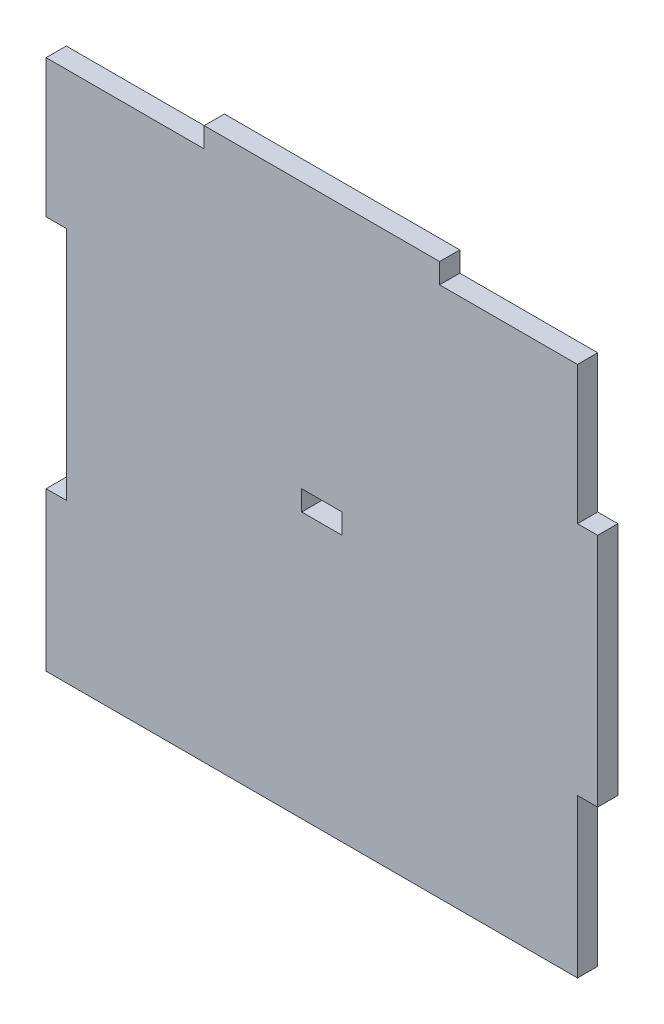
ISO-10303-21;
HEADER;
FILE_DESCRIPTION(('STEP AP214'),'2;1');
FILE_NAME('part.step','',(''),(''),'','','');
FILE_SCHEMA(('AUTOMOTIVE_DESIGN { 1 0 10303 214 1 1 1 1 }'));
ENDSEC;
DATA;
#1=APPLICATION_CONTEXT('core data for automotive mechanical design processes');
#2=APPLICATION_PROTOCOL_DEFINITION('international standard','automotive_design',2000,#1);
#3=PRODUCT_CONTEXT('',#1,'mechanical');
#4=PRODUCT('Part','Part','',(#3));
#5=PRODUCT_RELATED_PRODUCT_CATEGORY('part','',(#4));
#6=PRODUCT_DEFINITION_FORMATION('','',#4);
#7=PRODUCT_DEFINITION_CONTEXT('part definition',#1,'design');
#8=PRODUCT_DEFINITION('design','',#6,#7);
#9=PRODUCT_DEFINITION_SHAPE('','',#8);
#10=(LENGTH_UNIT() NAMED_UNIT(*) SI_UNIT(.MILLI.,.METRE.));
#11=(NAMED_UNIT(*) PLANE_ANGLE_UNIT() SI_UNIT($,.RADIAN.));
#12=(NAMED_UNIT(*) SI_UNIT($,.STERADIAN.) SOLID_ANGLE_UNIT());
#13=UNCERTAINTY_MEASURE_WITH_UNIT(LENGTH_MEASURE(1.E-05),#10,'distance_accuracy_value','');
#14=(GEOMETRIC_REPRESENTATION_CONTEXT(3) GLOBAL_UNCERTAINTY_ASSIGNED_CONTEXT((#13)) GLOBAL_UNIT_ASSIGNED_CONTEXT((#10,
#11,#12)) REPRESENTATION_CONTEXT('',''));
#15=CARTESIAN_POINT('',(0.,0.,0.));
#16=DIRECTION('',(0.,0.,1.));
#17=DIRECTION('',(1.,0.,0.));
#18=AXIS2_PLACEMENT_3D('',#15,#16,#17);
#19=CARTESIAN_POINT('',(38.,-16.,3.));
#20=DIRECTION('',(0.,1.,0.));
#21=DIRECTION('',(-1.,0.,0.));
#22=AXIS2_PLACEMENT_3D('',#19,#20,#21);
#23=PLANE('',#22);
#24=DIRECTION('',(1.,0.,0.));
#25=VECTOR('',#24,1.);
#26=CARTESIAN_POINT('',(38.,-16.,0.));
#27=LINE('',#26,#25);
#28=CARTESIAN_POINT('',(38.,-16.,0.));
#29=VERTEX_POINT('',#28);
#30=CARTESIAN_POINT('',(41.,-16.,0.));
#31=VERTEX_POINT('',#30);
#32=EDGE_CURVE('E218',#29,#31,#27,.T.);
#33=ORIENTED_EDGE('',*,*,#32,.T.);
#34=DIRECTION('',(0.,0.,-1.));
#35=VECTOR('',#34,1.);
#36=CARTESIAN_POINT('',(41.,-16.,3.));
#37=LINE('',#36,#35);
#38=CARTESIAN_POINT('',(41.,-16.,3.));
#39=VERTEX_POINT('',#38);
#40=EDGE_CURVE('E11',#39,#31,#37,.T.);
#41=ORIENTED_EDGE('',*,*,#40,.F.);
#42=DIRECTION('',(1.,0.,0.));
#43=VECTOR('',#42,1.);
#44=CARTESIAN_POINT('',(38.,-16.,3.));
#45=LINE('',#44,#43);
#46=CARTESIAN_POINT('',(38.,-16.,3.));
#47=VERTEX_POINT('',#46);
#48=EDGE_CURVE('E224',#47,#39,#45,.T.);
#49=ORIENTED_EDGE('',*,*,#48,.F.);
#50=DIRECTION('',(0.,0.,-1.));
#51=VECTOR('',#50,1.);
#52=CARTESIAN_POINT('',(38.,-16.,3.));
#53=LINE('',#52,#51);
#54=EDGE_CURVE('E274',#47,#29,#53,.T.);
#55=ORIENTED_EDGE('',*,*,#54,.T.);
#56=EDGE_LOOP('',(#33,#41,#49,#55));
#57=FACE_BOUND('',#56,.T.);
#58=ADVANCED_FACE('F38',(#57),#23,.F.);
#59=CARTESIAN_POINT('',(41.,16.,3.));
#60=DIRECTION('',(-1.,0.,0.));
#61=DIRECTION('',(0.,0.,1.));
#62=AXIS2_PLACEMENT_3D('',#59,#60,#61);
#63=PLANE('',#62);
#64=DIRECTION('',(0.,1.,0.));
#65=VECTOR('',#64,1.);
#66=CARTESIAN_POINT('',(41.,16.,0.));
#67=LINE('',#66,#65);
#68=CARTESIAN_POINT('',(41.,19.,0.));
#69=VERTEX_POINT('',#68);
#70=EDGE_CURVE('E278',#31,#69,#67,.T.);
#71=ORIENTED_EDGE('',*,*,#70,.T.);
#72=DIRECTION('',(0.,0.,-1.));
#73=VECTOR('',#72,1.);
#74=CARTESIAN_POINT('',(41.,19.,3.));
#75=LINE('',#74,#73);
#76=CARTESIAN_POINT('',(41.,19.,3.));
#77=VERTEX_POINT('',#76);
#78=EDGE_CURVE('E46',#77,#69,#75,.T.);
#79=ORIENTED_EDGE('',*,*,#78,.F.);
#80=DIRECTION('',(0.,1.,0.));
#81=VECTOR('',#80,1.);
#82=CARTESIAN_POINT('',(41.,16.,3.));
#83=LINE('',#82,#81);
#84=EDGE_CURVE('E228',#39,#77,#83,.T.);
#85=ORIENTED_EDGE('',*,*,#84,.F.);
#86=ORIENTED_EDGE('',*,*,#40,.T.);
#87=EDGE_LOOP('',(#71,#79,#85,#86));
#88=FACE_BOUND('',#87,.T.);
#89=ADVANCED_FACE('F407',(#88),#63,.F.);
#90=CARTESIAN_POINT('',(41.,19.,3.));
#91=DIRECTION('',(0.,-1.,0.));
#92=DIRECTION('',(0.,0.,-1.));
#93=AXIS2_PLACEMENT_3D('',#90,#91,#92);
#94=PLANE('',#93);
#95=DIRECTION('',(-1.,0.,0.));
#96=VECTOR('',#95,1.);
#97=CARTESIAN_POINT('',(41.,19.,0.));
#98=LINE('',#97,#96);
#99=CARTESIAN_POINT('',(38.,19.,0.));
#100=VERTEX_POINT('',#99);
#101=EDGE_CURVE('E281',#69,#100,#98,.T.);
#102=ORIENTED_EDGE('',*,*,#101,.T.);
#103=DIRECTION('',(0.,0.,-1.));
#104=VECTOR('',#103,1.);
#105=CARTESIAN_POINT('',(38.,19.,3.));
#106=LINE('',#105,#104);
#107=CARTESIAN_POINT('',(38.,19.,3.));
#108=VERTEX_POINT('',#107);
#109=EDGE_CURVE('E377',#108,#100,#106,.T.);
#110=ORIENTED_EDGE('',*,*,#109,.F.);
#111=DIRECTION('',(-1.,0.,0.));
#112=VECTOR('',#111,1.);
#113=CARTESIAN_POINT('',(41.,19.,3.));
#114=LINE('',#113,#112);
#115=EDGE_CURVE('E232',#77,#108,#114,.T.);
#116=ORIENTED_EDGE('',*,*,#115,.F.);
#117=ORIENTED_EDGE('',*,*,#78,.T.);
#118=EDGE_LOOP('',(#102,#110,#116,#117));
#119=FACE_BOUND('',#118,.T.);
#120=ADVANCED_FACE('F386',(#119),#94,.F.);
#121=CARTESIAN_POINT('',(38.,39.5,3.));
#122=DIRECTION('',(-1.,0.,0.));
#123=DIRECTION('',(0.,-1.,0.));
#124=AXIS2_PLACEMENT_3D('',#121,#122,#123);
#125=PLANE('',#124);
#126=DIRECTION('',(0.,1.,0.));
#127=VECTOR('',#126,1.);
#128=CARTESIAN_POINT('',(38.,39.5,0.));
#129=LINE('',#128,#127);
#130=CARTESIAN_POINT('',(38.,39.5,0.));
#131=VERTEX_POINT('',#130);
#132=EDGE_CURVE('E284',#100,#131,#129,.T.);
#133=ORIENTED_EDGE('',*,*,#132,.T.);
#134=DIRECTION('',(0.,0.,-1.));
#135=VECTOR('',#134,1.);
#136=CARTESIAN_POINT('',(38.,39.5,3.));
#137=LINE('',#136,#135);
#138=CARTESIAN_POINT('',(38.,39.5,3.));
#139=VERTEX_POINT('',#138);
#140=EDGE_CURVE('E373',#139,#131,#137,.T.);
#141=ORIENTED_EDGE('',*,*,#140,.F.);
#142=DIRECTION('',(0.,1.,0.));
#143=VECTOR('',#142,1.);
#144=CARTESIAN_POINT('',(38.,39.5,3.));
#145=LINE('',#144,#143);
#146=EDGE_CURVE('E235',#108,#139,#145,.T.);
#147=ORIENTED_EDGE('',*,*,#146,.F.);
#148=ORIENTED_EDGE('',*,*,#109,.T.);
#149=EDGE_LOOP('',(#133,#141,#147,#148));
#150=FACE_BOUND('',#149,.T.);
#151=ADVANCED_FACE('F395',(#150),#125,.F.);
#152=CARTESIAN_POINT('',(17.5,39.5,3.));
#153=DIRECTION('',(0.,-1.,0.));
#154=DIRECTION('',(1.,0.,0.));
#155=AXIS2_PLACEMENT_3D('',#152,#153,#154);
#156=PLANE('',#155);
#157=DIRECTION('',(-1.,0.,0.));
#158=VECTOR('',#157,1.);
#159=CARTESIAN_POINT('',(17.5,39.5,0.));
#160=LINE('',#159,#158);
#161=CARTESIAN_POINT('',(17.5,39.5,0.));
#162=VERTEX_POINT('',#161);
#163=EDGE_CURVE('E287',#131,#162,#160,.T.);
#164=ORIENTED_EDGE('',*,*,#163,.T.);
#165=DIRECTION('',(0.,0.,-1.));
#166=VECTOR('',#165,1.);
#167=CARTESIAN_POINT('',(17.5,39.5,3.));
#168=LINE('',#167,#166);
#169=CARTESIAN_POINT('',(17.5,39.5,3.));
#170=VERTEX_POINT('',#169);
#171=EDGE_CURVE('E369',#170,#162,#168,.T.);
#172=ORIENTED_EDGE('',*,*,#171,.F.);
#173=DIRECTION('',(-1.,0.,0.));
#174=VECTOR('',#173,1.);
#175=CARTESIAN_POINT('',(17.5,39.5,3.));
#176=LINE('',#175,#174);
#177=EDGE_CURVE('E238',#139,#170,#176,.T.);
#178=ORIENTED_EDGE('',*,*,#177,.F.);
#179=ORIENTED_EDGE('',*,*,#140,.T.);
#180=EDGE_LOOP('',(#164,#172,#178,#179));
#181=FACE_BOUND('',#180,.T.);
#182=ADVANCED_FACE('F399',(#181),#156,.F.);
#183=CARTESIAN_POINT('',(17.5,42.5,3.));
#184=DIRECTION('',(-1.,0.,0.));
#185=DIRECTION('',(0.,-1.,0.));
#186=AXIS2_PLACEMENT_3D('',#183,#184,#185);
#187=PLANE('',#186);
#188=DIRECTION('',(0.,1.,0.));
#189=VECTOR('',#188,1.);
#190=CARTESIAN_POINT('',(17.5,42.5,0.));
#191=LINE('',#190,#189);
#192=CARTESIAN_POINT('',(17.5,42.5,0.));
#193=VERTEX_POINT('',#192);
#194=EDGE_CURVE('E290',#162,#193,#191,.T.);
#195=ORIENTED_EDGE('',*,*,#194,.T.);
#196=DIRECTION('',(0.,0.,-1.));
#197=VECTOR('',#196,1.);
#198=CARTESIAN_POINT('',(17.5,42.5,3.));
#199=LINE('',#198,#197);
#200=CARTESIAN_POINT('',(17.5,42.5,3.));
#201=VERTEX_POINT('',#200);
#202=EDGE_CURVE('E365',#201,#193,#199,.T.);
#203=ORIENTED_EDGE('',*,*,#202,.F.);
#204=DIRECTION('',(0.,1.,0.));
#205=VECTOR('',#204,1.);
#206=CARTESIAN_POINT('',(17.5,42.5,3.));
#207=LINE('',#206,#205);
#208=EDGE_CURVE('E241',#170,#201,#207,.T.);
#209=ORIENTED_EDGE('',*,*,#208,.F.);
#210=ORIENTED_EDGE('',*,*,#171,.T.);
#211=EDGE_LOOP('',(#195,#203,#209,#210));
#212=FACE_BOUND('',#211,.T.);
#213=ADVANCED_FACE('F456',(#212),#187,.F.);
#214=CARTESIAN_POINT('',(-17.5,42.5,3.));
#215=DIRECTION('',(0.,-1.,0.));
#216=DIRECTION('',(0.,0.,-1.));
#217=AXIS2_PLACEMENT_3D('',#214,#215,#216);
#218=PLANE('',#217);
#219=DIRECTION('',(-1.,0.,0.));
#220=VECTOR('',#219,1.);
#221=CARTESIAN_POINT('',(-17.5,42.5,0.));
#222=LINE('',#221,#220);
#223=CARTESIAN_POINT('',(-17.5,42.5,0.));
#224=VERTEX_POINT('',#223);
#225=EDGE_CURVE('E293',#193,#224,#222,.T.);
#226=ORIENTED_EDGE('',*,*,#225,.T.);
#227=DIRECTION('',(0.,0.,-1.));
#228=VECTOR('',#227,1.);
#229=CARTESIAN_POINT('',(-17.5,42.5,3.));
#230=LINE('',#229,#228);
#231=CARTESIAN_POINT('',(-17.5,42.5,3.));
#232=VERTEX_POINT('',#231);
#233=EDGE_CURVE('E361',#232,#224,#230,.T.);
#234=ORIENTED_EDGE('',*,*,#233,.F.);
#235=DIRECTION('',(-1.,0.,0.));
#236=VECTOR('',#235,1.);
#237=CARTESIAN_POINT('',(-17.5,42.5,3.));
#238=LINE('',#237,#236);
#239=EDGE_CURVE('E244',#201,#232,#238,.T.);
#240=ORIENTED_EDGE('',*,*,#239,.F.);
#241=ORIENTED_EDGE('',*,*,#202,.T.);
#242=EDGE_LOOP('',(#226,#234,#240,#241));
#243=FACE_BOUND('',#242,.T.);
#244=ADVANCED_FACE('F454',(#243),#218,.F.);
#245=CARTESIAN_POINT('',(-17.5,39.5,3.));
#246=DIRECTION('',(1.,0.,0.));
#247=DIRECTION('',(0.,0.,-1.));
#248=AXIS2_PLACEMENT_3D('',#245,#246,#247);
#249=PLANE('',#248);
#250=DIRECTION('',(0.,-1.,0.));
#251=VECTOR('',#250,1.);
#252=CARTESIAN_POINT('',(-17.5,39.5,0.));
#253=LINE('',#252,#251);
#254=CARTESIAN_POINT('',(-17.5,39.5,0.));
#255=VERTEX_POINT('',#254);
#256=EDGE_CURVE('E296',#224,#255,#253,.T.);
#257=ORIENTED_EDGE('',*,*,#256,.T.);
#258=DIRECTION('',(0.,0.,-1.));
#259=VECTOR('',#258,1.);
#260=CARTESIAN_POINT('',(-17.5,39.5,3.));
#261=LINE('',#260,#259);
#262=CARTESIAN_POINT('',(-17.5,39.5,3.));
#263=VERTEX_POINT('',#262);
#264=EDGE_CURVE('E357',#263,#255,#261,.T.);
#265=ORIENTED_EDGE('',*,*,#264,.F.);
#266=DIRECTION('',(0.,-1.,0.));
#267=VECTOR('',#266,1.);
#268=CARTESIAN_POINT('',(-17.5,39.5,3.));
#269=LINE('',#268,#267);
#270=EDGE_CURVE('E247',#232,#263,#269,.T.);
#271=ORIENTED_EDGE('',*,*,#270,.F.);
#272=ORIENTED_EDGE('',*,*,#233,.T.);
#273=EDGE_LOOP('',(#257,#265,#271,#272));
#274=FACE_BOUND('',#273,.T.);
#275=ADVANCED_FACE('F447',(#274),#249,.F.);
#276=CARTESIAN_POINT('',(-41.,39.5,3.));
#277=DIRECTION('',(0.,-1.,0.));
#278=DIRECTION('',(0.,0.,-1.));
#279=AXIS2_PLACEMENT_3D('',#276,#277,#278);
#280=PLANE('',#279);
#281=DIRECTION('',(-1.,0.,0.));
#282=VECTOR('',#281,1.);
#283=CARTESIAN_POINT('',(-41.,39.5,0.));
#284=LINE('',#283,#282);
#285=CARTESIAN_POINT('',(-41.,39.5,0.));
#286=VERTEX_POINT('',#285);
#287=EDGE_CURVE('E300',#255,#286,#284,.T.);
#288=ORIENTED_EDGE('',*,*,#287,.T.);
#289=DIRECTION('',(0.,0.,-1.));
#290=VECTOR('',#289,1.);
#291=CARTESIAN_POINT('',(-41.,39.5,3.));
#292=LINE('',#291,#290);
#293=CARTESIAN_POINT('',(-41.,39.5,3.));
#294=VERTEX_POINT('',#293);
#295=EDGE_CURVE('E353',#294,#286,#292,.T.);
#296=ORIENTED_EDGE('',*,*,#295,.F.);
#297=DIRECTION('',(-1.,0.,0.));
#298=VECTOR('',#297,1.);
#299=CARTESIAN_POINT('',(-38.,39.5,3.));
#300=LINE('',#299,#298);
#301=EDGE_CURVE('E250',#263,#294,#300,.T.);
#302=ORIENTED_EDGE('',*,*,#301,.F.);
#303=ORIENTED_EDGE('',*,*,#264,.T.);
#304=EDGE_LOOP('',(#288,#296,#302,#303));
#305=FACE_BOUND('',#304,.T.);
#306=ADVANCED_FACE('F451',(#305),#280,.F.);
#307=CARTESIAN_POINT('',(-41.,19.,3.));
#308=DIRECTION('',(1.,0.,0.));
#309=DIRECTION('',(0.,1.,0.));
#310=AXIS2_PLACEMENT_3D('',#307,#308,#309);
#311=PLANE('',#310);
#312=DIRECTION('',(0.,-1.,0.));
#313=VECTOR('',#312,1.);
#314=CARTESIAN_POINT('',(-41.,19.,0.));
#315=LINE('',#314,#313);
#316=CARTESIAN_POINT('',(-41.,19.,0.));
#317=VERTEX_POINT('',#316);
#318=EDGE_CURVE('E303',#286,#317,#315,.T.);
#319=ORIENTED_EDGE('',*,*,#318,.T.);
#320=DIRECTION('',(0.,0.,-1.));
#321=VECTOR('',#320,1.);
#322=CARTESIAN_POINT('',(-41.,19.,3.));
#323=LINE('',#322,#321);
#324=CARTESIAN_POINT('',(-41.,19.,3.));
#325=VERTEX_POINT('',#324);
#326=EDGE_CURVE('E349',#325,#317,#323,.T.);
#327=ORIENTED_EDGE('',*,*,#326,.F.);
#328=DIRECTION('',(0.,-1.,0.));
#329=VECTOR('',#328,1.);
#330=CARTESIAN_POINT('',(-41.,19.,3.));
#331=LINE('',#330,#329);
#332=EDGE_CURVE('E253',#294,#325,#331,.T.);
#333=ORIENTED_EDGE('',*,*,#332,.F.);
#334=ORIENTED_EDGE('',*,*,#295,.T.);
#335=EDGE_LOOP('',(#319,#327,#333,#334));
#336=FACE_BOUND('',#335,.T.);
#337=ADVANCED_FACE('F440',(#336),#311,.F.);
#338=CARTESIAN_POINT('',(-38.,19.,3.));
#339=DIRECTION('',(0.,1.,0.));
#340=DIRECTION('',(-1.,0.,0.));
#341=AXIS2_PLACEMENT_3D('',#338,#339,#340);
#342=PLANE('',#341);
#343=DIRECTION('',(1.,0.,0.));
#344=VECTOR('',#343,1.);
#345=CARTESIAN_POINT('',(-38.,19.,0.));
#346=LINE('',#345,#344);
#347=CARTESIAN_POINT('',(-38.,19.,0.));
#348=VERTEX_POINT('',#347);
#349=EDGE_CURVE('E306',#317,#348,#346,.T.);
#350=ORIENTED_EDGE('',*,*,#349,.T.);
#351=DIRECTION('',(0.,0.,-1.));
#352=VECTOR('',#351,1.);
#353=CARTESIAN_POINT('',(-38.,19.,3.));
#354=LINE('',#353,#352);
#355=CARTESIAN_POINT('',(-38.,19.,3.));
#356=VERTEX_POINT('',#355);
#357=EDGE_CURVE('E345',#356,#348,#354,.T.);
#358=ORIENTED_EDGE('',*,*,#357,.F.);
#359=DIRECTION('',(1.,0.,0.));
#360=VECTOR('',#359,1.);
#361=CARTESIAN_POINT('',(-38.,19.,3.));
#362=LINE('',#361,#360);
#363=EDGE_CURVE('E256',#325,#356,#362,.T.);
#364=ORIENTED_EDGE('',*,*,#363,.F.);
#365=ORIENTED_EDGE('',*,*,#326,.T.);
#366=EDGE_LOOP('',(#350,#358,#364,#365));
#367=FACE_BOUND('',#366,.T.);
#368=ADVANCED_FACE('F435',(#367),#342,.F.);
#369=CARTESIAN_POINT('',(-38.,16.,3.));
#370=DIRECTION('',(1.,0.,0.));
#371=DIRECTION('',(0.,0.,-1.));
#372=AXIS2_PLACEMENT_3D('',#369,#370,#371);
#373=PLANE('',#372);
#374=DIRECTION('',(0.,-1.,0.));
#375=VECTOR('',#374,1.);
#376=CARTESIAN_POINT('',(-38.,16.,0.));
#377=LINE('',#376,#375);
#378=CARTESIAN_POINT('',(-38.,-16.,0.));
#379=VERTEX_POINT('',#378);
#380=EDGE_CURVE('E310',#348,#379,#377,.T.);
#381=ORIENTED_EDGE('',*,*,#380,.T.);
#382=DIRECTION('',(0.,0.,-1.));
#383=VECTOR('',#382,1.);
#384=CARTESIAN_POINT('',(-38.,-16.,3.));
#385=LINE('',#384,#383);
#386=CARTESIAN_POINT('',(-38.,-16.,3.));
#387=VERTEX_POINT('',#386);
#388=EDGE_CURVE('E341',#387,#379,#385,.T.);
#389=ORIENTED_EDGE('',*,*,#388,.F.);
#390=DIRECTION('',(0.,-1.,0.));
#391=VECTOR('',#390,1.);
#392=CARTESIAN_POINT('',(-38.,16.,3.));
#393=LINE('',#392,#391);
#394=EDGE_CURVE('E259',#356,#387,#393,.T.);
#395=ORIENTED_EDGE('',*,*,#394,.F.);
#396=ORIENTED_EDGE('',*,*,#357,.T.);
#397=EDGE_LOOP('',(#381,#389,#395,#396));
#398=FACE_BOUND('',#397,.T.);
#399=ADVANCED_FACE('F430',(#398),#373,.F.);
#400=CARTESIAN_POINT('',(-41.,-16.,3.));
#401=DIRECTION('',(0.,-1.,0.));
#402=DIRECTION('',(0.,0.,-1.));
#403=AXIS2_PLACEMENT_3D('',#400,#401,#402);
#404=PLANE('',#403);
#405=DIRECTION('',(-1.,0.,0.));
#406=VECTOR('',#405,1.);
#407=CARTESIAN_POINT('',(-41.,-16.,0.));
#408=LINE('',#407,#406);
#409=CARTESIAN_POINT('',(-41.,-16.,0.));
#410=VERTEX_POINT('',#409);
#411=EDGE_CURVE('E313',#379,#410,#408,.T.);
#412=ORIENTED_EDGE('',*,*,#411,.T.);
#413=DIRECTION('',(0.,0.,-1.));
#414=VECTOR('',#413,1.);
#415=CARTESIAN_POINT('',(-41.,-16.,3.));
#416=LINE('',#415,#414);
#417=CARTESIAN_POINT('',(-41.,-16.,3.));
#418=VERTEX_POINT('',#417);
#419=EDGE_CURVE('E337',#418,#410,#416,.T.);
#420=ORIENTED_EDGE('',*,*,#419,.F.);
#421=DIRECTION('',(-1.,0.,0.));
#422=VECTOR('',#421,1.);
#423=CARTESIAN_POINT('',(-41.,-16.,3.));
#424=LINE('',#423,#422);
#425=EDGE_CURVE('E262',#387,#418,#424,.T.);
#426=ORIENTED_EDGE('',*,*,#425,.F.);
#427=ORIENTED_EDGE('',*,*,#388,.T.);
#428=EDGE_LOOP('',(#412,#420,#426,#427));
#429=FACE_BOUND('',#428,.T.);
#430=ADVANCED_FACE('F426',(#429),#404,.F.);
#431=CARTESIAN_POINT('',(-41.,-19.,3.));
#432=DIRECTION('',(1.,0.,0.));
#433=DIRECTION('',(0.,1.,0.));
#434=AXIS2_PLACEMENT_3D('',#431,#432,#433);
#435=PLANE('',#434);
#436=DIRECTION('',(0.,-1.,0.));
#437=VECTOR('',#436,1.);
#438=CARTESIAN_POINT('',(-41.,-19.,0.));
#439=LINE('',#438,#437);
#440=CARTESIAN_POINT('',(-41.,-39.5,0.));
#441=VERTEX_POINT('',#440);
#442=EDGE_CURVE('E317',#410,#441,#439,.T.);
#443=ORIENTED_EDGE('',*,*,#442,.T.);
#444=DIRECTION('',(0.,0.,-1.));
#445=VECTOR('',#444,1.);
#446=CARTESIAN_POINT('',(-41.,-39.5,3.));
#447=LINE('',#446,#445);
#448=CARTESIAN_POINT('',(-41.,-39.5,3.));
#449=VERTEX_POINT('',#448);
#450=EDGE_CURVE('E333',#449,#441,#447,.T.);
#451=ORIENTED_EDGE('',*,*,#450,.F.);
#452=DIRECTION('',(0.,-1.,0.));
#453=VECTOR('',#452,1.);
#454=CARTESIAN_POINT('',(-41.,-19.,3.));
#455=LINE('',#454,#453);
#456=EDGE_CURVE('E265',#418,#449,#455,.T.);
#457=ORIENTED_EDGE('',*,*,#456,.F.);
#458=ORIENTED_EDGE('',*,*,#419,.T.);
#459=EDGE_LOOP('',(#443,#451,#457,#458));
#460=FACE_BOUND('',#459,.T.);
#461=ADVANCED_FACE('F423',(#460),#435,.F.);
#462=CARTESIAN_POINT('',(-41.,-39.5,3.));
#463=DIRECTION('',(0.,1.,0.));
#464=DIRECTION('',(0.,0.,1.));
#465=AXIS2_PLACEMENT_3D('',#462,#463,#464);
#466=PLANE('',#465);
#467=DIRECTION('',(1.,0.,0.));
#468=VECTOR('',#467,1.);
#469=CARTESIAN_POINT('',(-41.,-39.5,0.));
#470=LINE('',#469,#468);
#471=CARTESIAN_POINT('',(38.,-39.5,0.));
#472=VERTEX_POINT('',#471);
#473=EDGE_CURVE('E320',#441,#472,#470,.T.);
#474=ORIENTED_EDGE('',*,*,#473,.T.);
#475=DIRECTION('',(0.,0.,-1.));
#476=VECTOR('',#475,1.);
#477=CARTESIAN_POINT('',(38.,-39.5,3.));
#478=LINE('',#477,#476);
#479=CARTESIAN_POINT('',(38.,-39.5,3.));
#480=VERTEX_POINT('',#479);
#481=EDGE_CURVE('E329',#480,#472,#478,.T.);
#482=ORIENTED_EDGE('',*,*,#481,.F.);
#483=DIRECTION('',(1.,0.,0.));
#484=VECTOR('',#483,1.);
#485=CARTESIAN_POINT('',(-41.,-39.5,3.));
#486=LINE('',#485,#484);
#487=EDGE_CURVE('E268',#449,#480,#486,.T.);
#488=ORIENTED_EDGE('',*,*,#487,.F.);
#489=ORIENTED_EDGE('',*,*,#450,.T.);
#490=EDGE_LOOP('',(#474,#482,#488,#489));
#491=FACE_BOUND('',#490,.T.);
#492=ADVANCED_FACE('F414',(#491),#466,.F.);
#493=CARTESIAN_POINT('',(38.,-19.,3.));
#494=DIRECTION('',(-1.,0.,0.));
#495=DIRECTION('',(0.,-1.,0.));
#496=AXIS2_PLACEMENT_3D('',#493,#494,#495);
#497=PLANE('',#496);
#498=DIRECTION('',(0.,1.,0.));
#499=VECTOR('',#498,1.);
#500=CARTESIAN_POINT('',(38.,-19.,0.));
#501=LINE('',#500,#499);
#502=EDGE_CURVE('E229',#472,#29,#501,.T.);
#503=ORIENTED_EDGE('',*,*,#502,.T.);
#504=ORIENTED_EDGE('',*,*,#54,.F.);
#505=DIRECTION('',(0.,1.,0.));
#506=VECTOR('',#505,1.);
#507=CARTESIAN_POINT('',(38.,-19.,3.));
#508=LINE('',#507,#506);
#509=EDGE_CURVE('E271',#480,#47,#508,.T.);
#510=ORIENTED_EDGE('',*,*,#509,.F.);
#511=ORIENTED_EDGE('',*,*,#481,.T.);
#512=EDGE_LOOP('',(#503,#504,#510,#511));
#513=FACE_BOUND('',#512,.T.);
#514=ADVANCED_FACE('F418',(#513),#497,.F.);
#515=CARTESIAN_POINT('',(0.,0.,3.));
#516=DIRECTION('',(0.,0.,-1.));
#517=DIRECTION('',(-1.,0.,0.));
#518=AXIS2_PLACEMENT_3D('',#515,#516,#517);
#519=PLANE('',#518);
#520=DIRECTION('',(-1.,0.,0.));
#521=VECTOR('',#520,1.);
#522=CARTESIAN_POINT('',(-3.,3.,3.));
#523=LINE('',#522,#521);
#524=CARTESIAN_POINT('',(3.,3.,3.));
#525=VERTEX_POINT('',#524);
#526=CARTESIAN_POINT('',(-3.,3.,3.));
#527=VERTEX_POINT('',#526);
#528=EDGE_CURVE('E209',#525,#527,#523,.T.);
#529=ORIENTED_EDGE('',*,*,#528,.F.);
#530=DIRECTION('',(0.,1.,0.));
#531=VECTOR('',#530,1.);
#532=CARTESIAN_POINT('',(3.,3.,3.));
#533=LINE('',#532,#531);
#534=CARTESIAN_POINT('',(3.,0.,3.));
#535=VERTEX_POINT('',#534);
#536=EDGE_CURVE('E53',#535,#525,#533,.T.);
#537=ORIENTED_EDGE('',*,*,#536,.F.);
#538=DIRECTION('',(1.,0.,0.));
#539=VECTOR('',#538,1.);
#540=CARTESIAN_POINT('',(-3.,0.,3.));
#541=LINE('',#540,#539);
#542=CARTESIAN_POINT('',(-3.,0.,3.));
#543=VERTEX_POINT('',#542);
#544=EDGE_CURVE('E196',#543,#535,#541,.T.);
#545=ORIENTED_EDGE('',*,*,#544,.F.);
#546=DIRECTION('',(0.,-1.,0.));
#547=VECTOR('',#546,1.);
#548=CARTESIAN_POINT('',(-3.,3.,3.));
#549=LINE('',#548,#547);
#550=EDGE_CURVE('E200',#527,#543,#549,.T.);
#551=ORIENTED_EDGE('',*,*,#550,.F.);
#552=EDGE_LOOP('',(#529,#537,#545,#551));
#553=FACE_BOUND('',#552,.T.);
#554=ORIENTED_EDGE('',*,*,#48,.T.);
#555=ORIENTED_EDGE('',*,*,#84,.T.);
#556=ORIENTED_EDGE('',*,*,#115,.T.);
#557=ORIENTED_EDGE('',*,*,#146,.T.);
#558=ORIENTED_EDGE('',*,*,#177,.T.);
#559=ORIENTED_EDGE('',*,*,#208,.T.);
#560=ORIENTED_EDGE('',*,*,#239,.T.);
#561=ORIENTED_EDGE('',*,*,#270,.T.);
#562=ORIENTED_EDGE('',*,*,#301,.T.);
#563=ORIENTED_EDGE('',*,*,#332,.T.);
#564=ORIENTED_EDGE('',*,*,#363,.T.);
#565=ORIENTED_EDGE('',*,*,#394,.T.);
#566=ORIENTED_EDGE('',*,*,#425,.T.);
#567=ORIENTED_EDGE('',*,*,#456,.T.);
#568=ORIENTED_EDGE('',*,*,#487,.T.);
#569=ORIENTED_EDGE('',*,*,#509,.T.);
#570=EDGE_LOOP('',(#554,#555,#556,#557,#558,#559,#560,#561,#562,#563,#564,#565,#566,#567,#568,#569));
#571=FACE_BOUND('',#570,.T.);
#572=ADVANCED_FACE('F403',(#553,#571),#519,.F.);
#573=CARTESIAN_POINT('',(0.,0.,0.));
#574=DIRECTION('',(0.,0.,-1.));
#575=DIRECTION('',(-1.,0.,0.));
#576=AXIS2_PLACEMENT_3D('',#573,#574,#575);
#577=PLANE('',#576);
#578=DIRECTION('',(0.,1.,0.));
#579=VECTOR('',#578,1.);
#580=CARTESIAN_POINT('',(3.,3.,0.));
#581=LINE('',#580,#579);
#582=CARTESIAN_POINT('',(3.,0.,0.));
#583=VERTEX_POINT('',#582);
#584=CARTESIAN_POINT('',(3.,3.,0.));
#585=VERTEX_POINT('',#584);
#586=EDGE_CURVE('E177',#583,#585,#581,.T.);
#587=ORIENTED_EDGE('',*,*,#586,.T.);
#588=DIRECTION('',(-1.,0.,0.));
#589=VECTOR('',#588,1.);
#590=CARTESIAN_POINT('',(-3.,3.,0.));
#591=LINE('',#590,#589);
#592=CARTESIAN_POINT('',(-3.,3.,0.));
#593=VERTEX_POINT('',#592);
#594=EDGE_CURVE('E187',#585,#593,#591,.T.);
#595=ORIENTED_EDGE('',*,*,#594,.T.);
#596=DIRECTION('',(0.,-1.,0.));
#597=VECTOR('',#596,1.);
#598=CARTESIAN_POINT('',(-3.,3.,0.));
#599=LINE('',#598,#597);
#600=CARTESIAN_POINT('',(-3.,0.,0.));
#601=VERTEX_POINT('',#600);
#602=EDGE_CURVE('E61',#593,#601,#599,.T.);
#603=ORIENTED_EDGE('',*,*,#602,.T.);
#604=DIRECTION('',(1.,0.,0.));
#605=VECTOR('',#604,1.);
#606=CARTESIAN_POINT('',(-3.,0.,0.));
#607=LINE('',#606,#605);
#608=EDGE_CURVE('E184',#601,#583,#607,.T.);
#609=ORIENTED_EDGE('',*,*,#608,.T.);
#610=EDGE_LOOP('',(#587,#595,#603,#609));
#611=FACE_BOUND('',#610,.T.);
#612=ORIENTED_EDGE('',*,*,#32,.F.);
#613=ORIENTED_EDGE('',*,*,#502,.F.);
#614=ORIENTED_EDGE('',*,*,#473,.F.);
#615=ORIENTED_EDGE('',*,*,#442,.F.);
#616=ORIENTED_EDGE('',*,*,#411,.F.);
#617=ORIENTED_EDGE('',*,*,#380,.F.);
#618=ORIENTED_EDGE('',*,*,#349,.F.);
#619=ORIENTED_EDGE('',*,*,#318,.F.);
#620=ORIENTED_EDGE('',*,*,#287,.F.);
#621=ORIENTED_EDGE('',*,*,#256,.F.);
#622=ORIENTED_EDGE('',*,*,#225,.F.);
#623=ORIENTED_EDGE('',*,*,#194,.F.);
#624=ORIENTED_EDGE('',*,*,#163,.F.);
#625=ORIENTED_EDGE('',*,*,#132,.F.);
#626=ORIENTED_EDGE('',*,*,#101,.F.);
#627=ORIENTED_EDGE('',*,*,#70,.F.);
#628=EDGE_LOOP('',(#612,#613,#614,#615,#616,#617,#618,#619,#620,#621,#622,#623,#624,#625,#626,#627));
#629=FACE_BOUND('',#628,.T.);
#630=ADVANCED_FACE('F192',(#611,#629),#577,.T.);
#631=CARTESIAN_POINT('',(3.,3.,0.));
#632=DIRECTION('',(1.,0.,0.));
#633=DIRECTION('',(0.,1.,0.));
#634=AXIS2_PLACEMENT_3D('',#631,#632,#633);
#635=PLANE('',#634);
#636=ORIENTED_EDGE('',*,*,#536,.T.);
#637=DIRECTION('',(0.,0.,1.));
#638=VECTOR('',#637,1.);
#639=CARTESIAN_POINT('',(3.,3.,0.));
#640=LINE('',#639,#638);
#641=EDGE_CURVE('E173',#585,#525,#640,.T.);
#642=ORIENTED_EDGE('',*,*,#641,.F.);
#643=ORIENTED_EDGE('',*,*,#586,.F.);
#644=DIRECTION('',(0.,0.,1.));
#645=VECTOR('',#644,1.);
#646=CARTESIAN_POINT('',(3.,0.,0.));
#647=LINE('',#646,#645);
#648=EDGE_CURVE('E215',#583,#535,#647,.T.);
#649=ORIENTED_EDGE('',*,*,#648,.T.);
#650=EDGE_LOOP('',(#636,#642,#643,#649));
#651=FACE_BOUND('',#650,.T.);
#652=ADVANCED_FACE('F175',(#651),#635,.F.);
#653=CARTESIAN_POINT('',(-3.,0.,0.));
#654=DIRECTION('',(0.,-1.,0.));
#655=DIRECTION('',(0.,0.,-1.));
#656=AXIS2_PLACEMENT_3D('',#653,#654,#655);
#657=PLANE('',#656);
#658=ORIENTED_EDGE('',*,*,#544,.T.);
#659=ORIENTED_EDGE('',*,*,#648,.F.);
#660=ORIENTED_EDGE('',*,*,#608,.F.);
#661=DIRECTION('',(0.,0.,1.));
#662=VECTOR('',#661,1.);
#663=CARTESIAN_POINT('',(-3.,0.,0.));
#664=LINE('',#663,#662);
#665=EDGE_CURVE('E219',#601,#543,#664,.T.);
#666=ORIENTED_EDGE('',*,*,#665,.T.);
#667=EDGE_LOOP('',(#658,#659,#660,#666));
#668=FACE_BOUND('',#667,.T.);
#669=ADVANCED_FACE('F591',(#668),#657,.F.);
#670=CARTESIAN_POINT('',(-3.,3.,0.));
#671=DIRECTION('',(-1.,0.,0.));
#672=DIRECTION('',(0.,-1.,0.));
#673=AXIS2_PLACEMENT_3D('',#670,#671,#672);
#674=PLANE('',#673);
#675=ORIENTED_EDGE('',*,*,#550,.T.);
#676=ORIENTED_EDGE('',*,*,#665,.F.);
#677=ORIENTED_EDGE('',*,*,#602,.F.);
#678=DIRECTION('',(0.,0.,1.));
#679=VECTOR('',#678,1.);
#680=CARTESIAN_POINT('',(-3.,3.,0.));
#681=LINE('',#680,#679);
#682=EDGE_CURVE('E183',#593,#527,#681,.T.);
#683=ORIENTED_EDGE('',*,*,#682,.T.);
#684=EDGE_LOOP('',(#675,#676,#677,#683));
#685=FACE_BOUND('',#684,.T.);
#686=ADVANCED_FACE('F600',(#685),#674,.F.);
#687=CARTESIAN_POINT('',(-3.,3.,0.));
#688=DIRECTION('',(0.,1.,0.));
#689=DIRECTION('',(0.,0.,1.));
#690=AXIS2_PLACEMENT_3D('',#687,#688,#689);
#691=PLANE('',#690);
#692=ORIENTED_EDGE('',*,*,#528,.T.);
#693=ORIENTED_EDGE('',*,*,#682,.F.);
#694=ORIENTED_EDGE('',*,*,#594,.F.);
#695=ORIENTED_EDGE('',*,*,#641,.T.);
#696=EDGE_LOOP('',(#692,#693,#694,#695));
#697=FACE_BOUND('',#696,.T.);
#698=ADVANCED_FACE('F188',(#697),#691,.F.);
#699=CLOSED_SHELL('',(#58,#89,#120,#151,#182,#213,#244,#275,#306,#337,#368,#399,#430,#461,#492,
#514,#572,#630,#652,#669,#686,#698));
#700=MANIFOLD_SOLID_BREP('B2',#699);
#701=ADVANCED_BREP_SHAPE_REPRESENTATION('',(#18,#700),#14);
#702=SHAPE_DEFINITION_REPRESENTATION(#9,#701);
ENDSEC;
END-ISO-10303-21;
